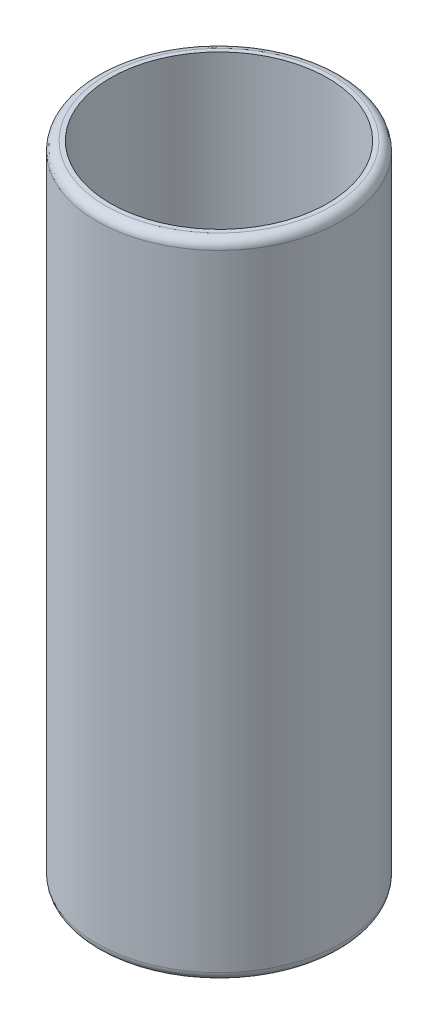
ISO-10303-21;
HEADER;
FILE_DESCRIPTION(('STEP AP214'),'2;1');
FILE_NAME('part.step','',(''),(''),'','','');
FILE_SCHEMA(('AUTOMOTIVE_DESIGN { 1 0 10303 214 1 1 1 1 }'));
ENDSEC;
DATA;
#1=APPLICATION_CONTEXT('core data for automotive mechanical design processes');
#2=APPLICATION_PROTOCOL_DEFINITION('international standard','automotive_design',2000,#1);
#3=PRODUCT_CONTEXT('',#1,'mechanical');
#4=PRODUCT('Part','Part','',(#3));
#5=PRODUCT_RELATED_PRODUCT_CATEGORY('part','',(#4));
#6=PRODUCT_DEFINITION_FORMATION('','',#4);
#7=PRODUCT_DEFINITION_CONTEXT('part definition',#1,'design');
#8=PRODUCT_DEFINITION('design','',#6,#7);
#9=PRODUCT_DEFINITION_SHAPE('','',#8);
#10=(LENGTH_UNIT() NAMED_UNIT(*) SI_UNIT(.MILLI.,.METRE.));
#11=(NAMED_UNIT(*) PLANE_ANGLE_UNIT() SI_UNIT($,.RADIAN.));
#12=(NAMED_UNIT(*) SI_UNIT($,.STERADIAN.) SOLID_ANGLE_UNIT());
#13=UNCERTAINTY_MEASURE_WITH_UNIT(LENGTH_MEASURE(1.E-05),#10,'distance_accuracy_value','');
#14=(GEOMETRIC_REPRESENTATION_CONTEXT(3) GLOBAL_UNCERTAINTY_ASSIGNED_CONTEXT((#13)) GLOBAL_UNIT_ASSIGNED_CONTEXT((#10,
#11,#12)) REPRESENTATION_CONTEXT('',''));
#15=CARTESIAN_POINT('',(0.,0.,0.));
#16=DIRECTION('',(0.,0.,1.));
#17=DIRECTION('',(1.,0.,0.));
#18=AXIS2_PLACEMENT_3D('',#15,#16,#17);
#19=CARTESIAN_POINT('',(0.,72.5,0.));
#20=DIRECTION('',(0.,-1.,0.));
#21=DIRECTION('',(0.,0.,-1.));
#22=AXIS2_PLACEMENT_3D('',#19,#20,#21);
#23=CYLINDRICAL_SURFACE('',#22,13.75);
#24=CARTESIAN_POINT('',(0.,71.5,0.));
#25=DIRECTION('',(0.,1.,0.));
#26=DIRECTION('',(0.,0.,1.));
#27=AXIS2_PLACEMENT_3D('',#24,#25,#26);
#28=CIRCLE('',#27,13.75);
#29=CARTESIAN_POINT('',(0.,71.5,13.75));
#30=VERTEX_POINT('',#29);
#31=EDGE_CURVE('E45',#30,#30,#28,.F.);
#32=ORIENTED_EDGE('',*,*,#31,.T.);
#33=EDGE_LOOP('',(#32));
#34=FACE_BOUND('',#33,.T.);
#35=CARTESIAN_POINT('',(0.,1.,0.));
#36=DIRECTION('',(0.,1.,0.));
#37=DIRECTION('',(0.,0.,1.));
#38=AXIS2_PLACEMENT_3D('',#35,#36,#37);
#39=CIRCLE('',#38,13.75);
#40=CARTESIAN_POINT('',(0.,1.,13.75));
#41=VERTEX_POINT('',#40);
#42=EDGE_CURVE('E50',#41,#41,#39,.T.);
#43=ORIENTED_EDGE('',*,*,#42,.T.);
#44=EDGE_LOOP('',(#43));
#45=FACE_BOUND('',#44,.T.);
#46=ADVANCED_FACE('F37',(#34,#45),#23,.T.);
#47=CARTESIAN_POINT('',(0.,72.5,0.));
#48=DIRECTION('',(0.,1.,0.));
#49=DIRECTION('',(0.,0.,1.));
#50=AXIS2_PLACEMENT_3D('',#47,#48,#49);
#51=PLANE('',#50);
#52=CARTESIAN_POINT('',(0.,72.5,0.));
#53=DIRECTION('',(0.,1.,0.));
#54=DIRECTION('',(0.,0.,1.));
#55=AXIS2_PLACEMENT_3D('',#52,#53,#54);
#56=CIRCLE('',#55,12.75);
#57=CARTESIAN_POINT('',(0.,72.5,12.75));
#58=VERTEX_POINT('',#57);
#59=EDGE_CURVE('E55',#58,#58,#56,.T.);
#60=ORIENTED_EDGE('',*,*,#59,.T.);
#61=EDGE_LOOP('',(#60));
#62=FACE_BOUND('',#61,.T.);
#63=CARTESIAN_POINT('',(0.,72.5,0.));
#64=DIRECTION('',(0.,1.,0.));
#65=DIRECTION('',(0.,0.,1.));
#66=AXIS2_PLACEMENT_3D('',#63,#64,#65);
#67=CIRCLE('',#66,12.25);
#68=CARTESIAN_POINT('',(0.,72.5,12.25));
#69=VERTEX_POINT('',#68);
#70=EDGE_CURVE('E62',#69,#69,#67,.T.);
#71=ORIENTED_EDGE('',*,*,#70,.F.);
#72=EDGE_LOOP('',(#71));
#73=FACE_BOUND('',#72,.T.);
#74=ADVANCED_FACE('F79',(#62,#73),#51,.T.);
#75=CARTESIAN_POINT('',(0.,0.,0.));
#76=DIRECTION('',(0.,1.,0.));
#77=DIRECTION('',(0.,0.,1.));
#78=AXIS2_PLACEMENT_3D('',#75,#76,#77);
#79=PLANE('',#78);
#80=CARTESIAN_POINT('',(0.,0.,0.));
#81=DIRECTION('',(0.,1.,0.));
#82=DIRECTION('',(0.,0.,1.));
#83=AXIS2_PLACEMENT_3D('',#80,#81,#82);
#84=CIRCLE('',#83,12.75);
#85=CARTESIAN_POINT('',(0.,0.,12.75));
#86=VERTEX_POINT('',#85);
#87=EDGE_CURVE('E10',#86,#86,#84,.F.);
#88=ORIENTED_EDGE('',*,*,#87,.T.);
#89=EDGE_LOOP('',(#88));
#90=FACE_BOUND('',#89,.T.);
#91=ADVANCED_FACE('F75',(#90),#79,.F.);
#92=CARTESIAN_POINT('',(0.,1.5,0.));
#93=DIRECTION('',(0.,1.,0.));
#94=DIRECTION('',(0.,0.,1.));
#95=AXIS2_PLACEMENT_3D('',#92,#93,#94);
#96=CYLINDRICAL_SURFACE('',#95,12.25);
#97=CARTESIAN_POINT('',(0.,1.5,0.));
#98=DIRECTION('',(0.,1.,0.));
#99=DIRECTION('',(0.,0.,1.));
#100=AXIS2_PLACEMENT_3D('',#97,#98,#99);
#101=CIRCLE('',#100,12.25);
#102=CARTESIAN_POINT('',(0.,1.5,12.25));
#103=VERTEX_POINT('',#102);
#104=EDGE_CURVE('E61',#103,#103,#101,.T.);
#105=ORIENTED_EDGE('',*,*,#104,.F.);
#106=EDGE_LOOP('',(#105));
#107=FACE_BOUND('',#106,.T.);
#108=ORIENTED_EDGE('',*,*,#70,.T.);
#109=EDGE_LOOP('',(#108));
#110=FACE_BOUND('',#109,.T.);
#111=ADVANCED_FACE('F72',(#107,#110),#96,.F.);
#112=CARTESIAN_POINT('',(0.,1.5,0.));
#113=DIRECTION('',(0.,1.,0.));
#114=DIRECTION('',(0.,0.,1.));
#115=AXIS2_PLACEMENT_3D('',#112,#113,#114);
#116=PLANE('',#115);
#117=ORIENTED_EDGE('',*,*,#104,.T.);
#118=EDGE_LOOP('',(#117));
#119=FACE_BOUND('',#118,.T.);
#120=ADVANCED_FACE('F70',(#119),#116,.T.);
#121=CARTESIAN_POINT('',(0.,71.5,0.));
#122=DIRECTION('',(0.,1.,0.));
#123=DIRECTION('',(0.,0.,1.));
#124=AXIS2_PLACEMENT_3D('',#121,#122,#123);
#125=TOROIDAL_SURFACE('',#124,12.75,1.);
#126=ORIENTED_EDGE('',*,*,#31,.F.);
#127=EDGE_LOOP('',(#126));
#128=FACE_BOUND('',#127,.T.);
#129=ORIENTED_EDGE('',*,*,#59,.F.);
#130=EDGE_LOOP('',(#129));
#131=FACE_BOUND('',#130,.T.);
#132=ADVANCED_FACE('F90',(#128,#131),#125,.T.);
#133=CARTESIAN_POINT('',(0.,1.,0.));
#134=DIRECTION('',(0.,1.,0.));
#135=DIRECTION('',(0.,0.,1.));
#136=AXIS2_PLACEMENT_3D('',#133,#134,#135);
#137=TOROIDAL_SURFACE('',#136,12.75,1.);
#138=ORIENTED_EDGE('',*,*,#87,.F.);
#139=EDGE_LOOP('',(#138));
#140=FACE_BOUND('',#139,.T.);
#141=ORIENTED_EDGE('',*,*,#42,.F.);
#142=EDGE_LOOP('',(#141));
#143=FACE_BOUND('',#142,.T.);
#144=ADVANCED_FACE('F39',(#140,#143),#137,.T.);
#145=CLOSED_SHELL('',(#46,#74,#91,#111,#120,#132,#144));
#146=MANIFOLD_SOLID_BREP('B2',#145);
#147=ADVANCED_BREP_SHAPE_REPRESENTATION('',(#18,#146),#14);
#148=SHAPE_DEFINITION_REPRESENTATION(#9,#147);
ENDSEC;
END-ISO-10303-21;
